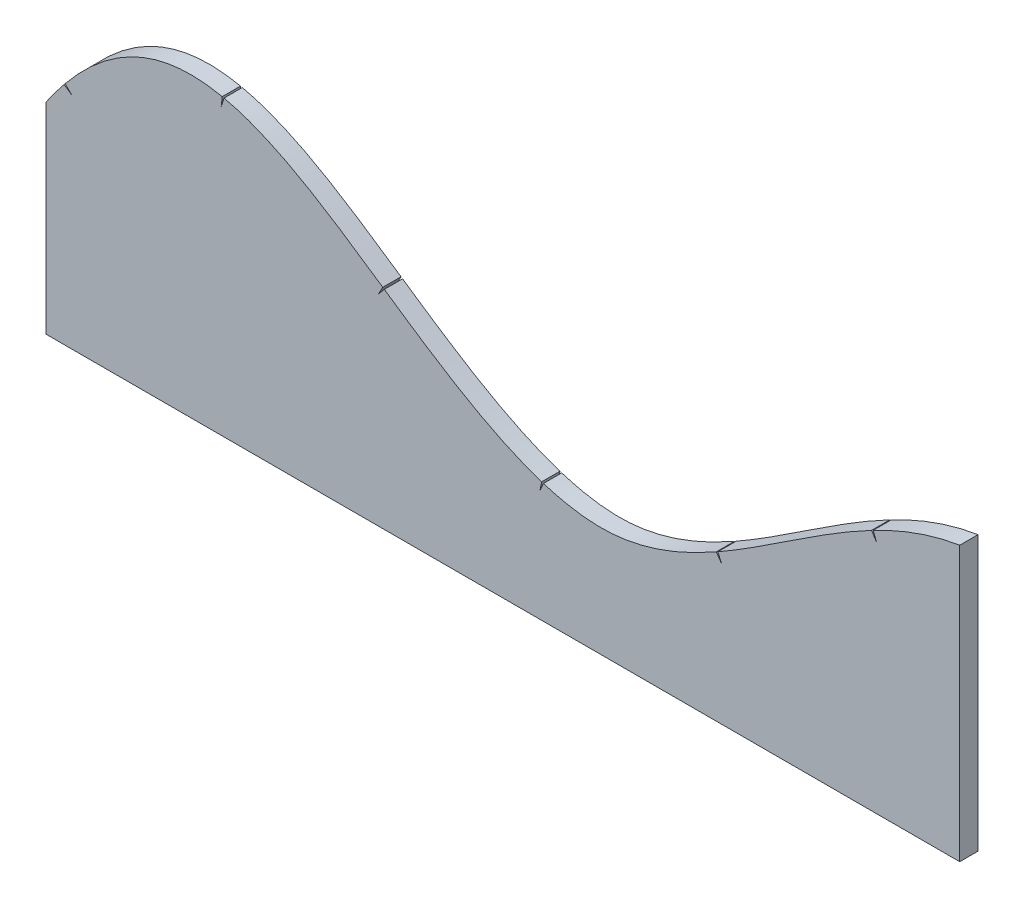
ISO-10303-21;
HEADER;
FILE_DESCRIPTION(('STEP AP214'),'2;1');
FILE_NAME('part.step','',(''),(''),'','','');
FILE_SCHEMA(('AUTOMOTIVE_DESIGN { 1 0 10303 214 1 1 1 1 }'));
ENDSEC;
DATA;
#1=APPLICATION_CONTEXT('core data for automotive mechanical design processes');
#2=APPLICATION_PROTOCOL_DEFINITION('international standard','automotive_design',2000,#1);
#3=PRODUCT_CONTEXT('',#1,'mechanical');
#4=PRODUCT('Part','Part','',(#3));
#5=PRODUCT_RELATED_PRODUCT_CATEGORY('part','',(#4));
#6=PRODUCT_DEFINITION_FORMATION('','',#4);
#7=PRODUCT_DEFINITION_CONTEXT('part definition',#1,'design');
#8=PRODUCT_DEFINITION('design','',#6,#7);
#9=PRODUCT_DEFINITION_SHAPE('','',#8);
#10=(LENGTH_UNIT() NAMED_UNIT(*) SI_UNIT(.MILLI.,.METRE.));
#11=(NAMED_UNIT(*) PLANE_ANGLE_UNIT() SI_UNIT($,.RADIAN.));
#12=(NAMED_UNIT(*) SI_UNIT($,.STERADIAN.) SOLID_ANGLE_UNIT());
#13=UNCERTAINTY_MEASURE_WITH_UNIT(LENGTH_MEASURE(1.E-05),#10,'distance_accuracy_value','');
#14=(GEOMETRIC_REPRESENTATION_CONTEXT(3) GLOBAL_UNCERTAINTY_ASSIGNED_CONTEXT((#13)) GLOBAL_UNIT_ASSIGNED_CONTEXT((#10,
#11,#12)) REPRESENTATION_CONTEXT('',''));
#15=CARTESIAN_POINT('',(0.,0.,0.));
#16=DIRECTION('',(0.,0.,1.));
#17=DIRECTION('',(1.,0.,0.));
#18=AXIS2_PLACEMENT_3D('',#15,#16,#17);
#19=CARTESIAN_POINT('',(2500.,1500.,100.));
#20=CARTESIAN_POINT('',(1794.60890413008,1389.62794411327,100.));
#21=CARTESIAN_POINT('',(898.832611168576,213.225882742989,100.));
#22=CARTESIAN_POINT('',(-869.308497066313,1207.64704133542,100.));
#23=CARTESIAN_POINT('',(-1828.84848091354,2075.83695286691,100.));
#24=CARTESIAN_POINT('',(-2500.,1100.,100.));
#25=B_SPLINE_CURVE_WITH_KNOTS('',3,(#19,#20,#21,#22,#23,#24),.UNSPECIFIED.,.F.,.F.,(4,1,1,4),
(0.,0.386573634956552,0.581979176283233,1.),.UNSPECIFIED.);
#26=DIRECTION('',(0.,0.,-1.));
#27=VECTOR('',#26,1.);
#28=SURFACE_OF_LINEAR_EXTRUSION('',#25,#27);
#29=CARTESIAN_POINT('',(2500.,1500.,0.));
#30=CARTESIAN_POINT('',(1794.60890413008,1389.62794411327,0.));
#31=CARTESIAN_POINT('',(898.832611168576,213.225882742989,0.));
#32=CARTESIAN_POINT('',(-869.308497066313,1207.64704133542,0.));
#33=CARTESIAN_POINT('',(-1828.84848091354,2075.83695286691,0.));
#34=CARTESIAN_POINT('',(-2500.,1100.,0.));
#35=B_SPLINE_CURVE_WITH_KNOTS('',3,(#29,#30,#31,#32,#33,#34),.UNSPECIFIED.,.F.,.F.,(4,1,1,4),
(0.,0.386573634956552,0.581979176283233,1.),.UNSPECIFIED.);
#36=CARTESIAN_POINT('',(-657.024415573471,1143.67553962413,0.));
#37=VERTEX_POINT('',#36);
#38=CARTESIAN_POINT('',(-1525.84913471507,1605.95378303103,0.));
#39=VERTEX_POINT('',#38);
#40=EDGE_CURVE('E442',#37,#39,#35,.T.);
#41=ORIENTED_EDGE('',*,*,#40,.T.);
#42=DIRECTION('',(0.,0.,-1.));
#43=VECTOR('',#42,1.);
#44=CARTESIAN_POINT('',(-1525.84913471507,1605.95378303104,100.));
#45=LINE('',#44,#43);
#46=CARTESIAN_POINT('',(-1525.84913471507,1605.95378303103,100.));
#47=VERTEX_POINT('',#46);
#48=EDGE_CURVE('E312',#39,#47,#45,.F.);
#49=ORIENTED_EDGE('',*,*,#48,.T.);
#50=CARTESIAN_POINT('',(-657.024415573471,1143.67553962413,100.));
#51=VERTEX_POINT('',#50);
#52=EDGE_CURVE('E500',#51,#47,#25,.T.);
#53=ORIENTED_EDGE('',*,*,#52,.F.);
#54=DIRECTION('',(0.,0.,-1.));
#55=VECTOR('',#54,1.);
#56=CARTESIAN_POINT('',(-657.024416114455,1143.6755399937,0.));
#57=LINE('',#56,#55);
#58=EDGE_CURVE('E308',#37,#51,#57,.F.);
#59=ORIENTED_EDGE('',*,*,#58,.F.);
#60=EDGE_LOOP('',(#41,#49,#53,#59));
#61=FACE_BOUND('',#60,.T.);
#62=ADVANCED_FACE('F35',(#61),#28,.F.);
#63=CARTESIAN_POINT('',(212.561468705833,656.843347329363,0.));
#64=VERTEX_POINT('',#63);
#65=CARTESIAN_POINT('',(-648.767193373434,1138.03476019735,0.));
#66=VERTEX_POINT('',#65);
#67=EDGE_CURVE('E445',#64,#66,#35,.T.);
#68=ORIENTED_EDGE('',*,*,#67,.T.);
#69=DIRECTION('',(0.,0.,-1.));
#70=VECTOR('',#69,1.);
#71=CARTESIAN_POINT('',(-648.767192386376,1138.03475952309,0.));
#72=LINE('',#71,#70);
#73=CARTESIAN_POINT('',(-648.767193373434,1138.03476019735,100.));
#74=VERTEX_POINT('',#73);
#75=EDGE_CURVE('E39',#66,#74,#72,.F.);
#76=ORIENTED_EDGE('',*,*,#75,.T.);
#77=CARTESIAN_POINT('',(212.561468705833,656.843347329363,100.));
#78=VERTEX_POINT('',#77);
#79=EDGE_CURVE('E354',#78,#74,#25,.T.);
#80=ORIENTED_EDGE('',*,*,#79,.F.);
#81=DIRECTION('',(0.,0.,-1.));
#82=VECTOR('',#81,1.);
#83=CARTESIAN_POINT('',(212.561468705833,656.843347329363,100.));
#84=LINE('',#83,#82);
#85=EDGE_CURVE('E302',#78,#64,#84,.T.);
#86=ORIENTED_EDGE('',*,*,#85,.T.);
#87=EDGE_LOOP('',(#68,#76,#80,#86));
#88=FACE_BOUND('',#87,.T.);
#89=ADVANCED_FACE('F432',(#88),#28,.F.);
#90=CARTESIAN_POINT('',(1167.74932960574,802.292417079743,0.));
#91=VERTEX_POINT('',#90);
#92=CARTESIAN_POINT('',(222.090144024189,653.803702021845,0.));
#93=VERTEX_POINT('',#92);
#94=EDGE_CURVE('E448',#91,#93,#35,.T.);
#95=ORIENTED_EDGE('',*,*,#94,.T.);
#96=DIRECTION('',(0.,0.,-1.));
#97=VECTOR('',#96,1.);
#98=CARTESIAN_POINT('',(222.090144024189,653.803702021845,100.));
#99=LINE('',#98,#97);
#100=CARTESIAN_POINT('',(222.090144024189,653.803702021845,100.));
#101=VERTEX_POINT('',#100);
#102=EDGE_CURVE('E305',#93,#101,#99,.F.);
#103=ORIENTED_EDGE('',*,*,#102,.T.);
#104=CARTESIAN_POINT('',(1167.74932960574,802.292417079743,100.));
#105=VERTEX_POINT('',#104);
#106=EDGE_CURVE('E501',#105,#101,#25,.T.);
#107=ORIENTED_EDGE('',*,*,#106,.F.);
#108=DIRECTION('',(0.,0.,-1.));
#109=VECTOR('',#108,1.);
#110=CARTESIAN_POINT('',(1167.74932960574,802.292417079743,100.));
#111=LINE('',#110,#109);
#112=EDGE_CURVE('E296',#105,#91,#111,.T.);
#113=ORIENTED_EDGE('',*,*,#112,.T.);
#114=EDGE_LOOP('',(#95,#103,#107,#113));
#115=FACE_BOUND('',#114,.T.);
#116=ADVANCED_FACE('F437',(#115),#28,.F.);
#117=CARTESIAN_POINT('',(2017.35673015273,1329.02244352963,0.));
#118=VERTEX_POINT('',#117);
#119=CARTESIAN_POINT('',(1176.45451786146,807.215461224853,0.));
#120=VERTEX_POINT('',#119);
#121=EDGE_CURVE('E457',#118,#120,#35,.T.);
#122=ORIENTED_EDGE('',*,*,#121,.T.);
#123=DIRECTION('',(0.,0.,-1.));
#124=VECTOR('',#123,1.);
#125=CARTESIAN_POINT('',(1176.45451786146,807.215461224853,100.));
#126=LINE('',#125,#124);
#127=CARTESIAN_POINT('',(1176.45451786146,807.215461224853,100.));
#128=VERTEX_POINT('',#127);
#129=EDGE_CURVE('E299',#120,#128,#126,.F.);
#130=ORIENTED_EDGE('',*,*,#129,.T.);
#131=CARTESIAN_POINT('',(2017.35673015273,1329.02244352963,100.));
#132=VERTEX_POINT('',#131);
#133=EDGE_CURVE('E353',#132,#128,#25,.T.);
#134=ORIENTED_EDGE('',*,*,#133,.F.);
#135=DIRECTION('',(0.,0.,-1.));
#136=VECTOR('',#135,1.);
#137=CARTESIAN_POINT('',(2017.35673015273,1329.02244352963,100.));
#138=LINE('',#137,#136);
#139=EDGE_CURVE('E289',#132,#118,#138,.T.);
#140=ORIENTED_EDGE('',*,*,#139,.T.);
#141=EDGE_LOOP('',(#122,#130,#134,#140));
#142=FACE_BOUND('',#141,.T.);
#143=ADVANCED_FACE('F606',(#142),#28,.F.);
#144=CARTESIAN_POINT('',(2500.,1500.,0.));
#145=VERTEX_POINT('',#144);
#146=CARTESIAN_POINT('',(2026.22728048429,1333.63695690014,0.));
#147=VERTEX_POINT('',#146);
#148=EDGE_CURVE('E449',#145,#147,#35,.T.);
#149=ORIENTED_EDGE('',*,*,#148,.T.);
#150=DIRECTION('',(0.,0.,-1.));
#151=VECTOR('',#150,1.);
#152=CARTESIAN_POINT('',(2026.22728048369,1333.63695690165,100.));
#153=LINE('',#152,#151);
#154=CARTESIAN_POINT('',(2026.22728048429,1333.63695690014,100.));
#155=VERTEX_POINT('',#154);
#156=EDGE_CURVE('E292',#147,#155,#153,.F.);
#157=ORIENTED_EDGE('',*,*,#156,.T.);
#158=CARTESIAN_POINT('',(2500.,1500.,100.));
#159=VERTEX_POINT('',#158);
#160=EDGE_CURVE('E346',#159,#155,#25,.T.);
#161=ORIENTED_EDGE('',*,*,#160,.F.);
#162=DIRECTION('',(0.,0.,-1.));
#163=VECTOR('',#162,1.);
#164=CARTESIAN_POINT('',(2500.,1500.,100.));
#165=LINE('',#164,#163);
#166=EDGE_CURVE('E473',#159,#145,#165,.T.);
#167=ORIENTED_EDGE('',*,*,#166,.T.);
#168=EDGE_LOOP('',(#149,#157,#161,#167));
#169=FACE_BOUND('',#168,.T.);
#170=ADVANCED_FACE('F614',(#169),#28,.F.);
#171=CARTESIAN_POINT('',(-1535.6218061162,1608.06171098821,100.));
#172=VERTEX_POINT('',#171);
#173=CARTESIAN_POINT('',(-2395.14412456295,1240.10126913903,100.));
#174=VERTEX_POINT('',#173);
#175=EDGE_CURVE('E498',#172,#174,#25,.T.);
#176=ORIENTED_EDGE('',*,*,#175,.F.);
#177=DIRECTION('',(0.,0.,-1.));
#178=VECTOR('',#177,1.);
#179=CARTESIAN_POINT('',(-1535.6218061162,1608.06171098821,100.));
#180=LINE('',#179,#178);
#181=CARTESIAN_POINT('',(-1535.6218061162,1608.06171098821,0.));
#182=VERTEX_POINT('',#181);
#183=EDGE_CURVE('E309',#172,#182,#180,.T.);
#184=ORIENTED_EDGE('',*,*,#183,.T.);
#185=CARTESIAN_POINT('',(-2395.14412456295,1240.10126913903,0.));
#186=VERTEX_POINT('',#185);
#187=EDGE_CURVE('E446',#182,#186,#35,.T.);
#188=ORIENTED_EDGE('',*,*,#187,.T.);
#189=DIRECTION('',(0.,0.,-1.));
#190=VECTOR('',#189,1.);
#191=CARTESIAN_POINT('',(-2395.14412456367,1240.10126913975,100.));
#192=LINE('',#191,#190);
#193=EDGE_CURVE('E337',#186,#174,#192,.F.);
#194=ORIENTED_EDGE('',*,*,#193,.T.);
#195=EDGE_LOOP('',(#176,#184,#188,#194));
#196=FACE_BOUND('',#195,.T.);
#197=ADVANCED_FACE('F364',(#196),#28,.F.);
#198=CARTESIAN_POINT('',(2500.,1500.,100.));
#199=DIRECTION('',(-1.,0.,0.));
#200=DIRECTION('',(0.,-1.,0.));
#201=AXIS2_PLACEMENT_3D('',#198,#199,#200);
#202=PLANE('',#201);
#203=DIRECTION('',(0.,1.,0.));
#204=VECTOR('',#203,1.);
#205=CARTESIAN_POINT('',(2500.,1500.,0.));
#206=LINE('',#205,#204);
#207=CARTESIAN_POINT('',(2500.,0.,0.));
#208=VERTEX_POINT('',#207);
#209=EDGE_CURVE('E340',#208,#145,#206,.T.);
#210=ORIENTED_EDGE('',*,*,#209,.T.);
#211=ORIENTED_EDGE('',*,*,#166,.F.);
#212=DIRECTION('',(0.,1.,0.));
#213=VECTOR('',#212,1.);
#214=CARTESIAN_POINT('',(2500.,1500.,100.));
#215=LINE('',#214,#213);
#216=CARTESIAN_POINT('',(2500.,0.,100.));
#217=VERTEX_POINT('',#216);
#218=EDGE_CURVE('E341',#217,#159,#215,.T.);
#219=ORIENTED_EDGE('',*,*,#218,.F.);
#220=DIRECTION('',(0.,0.,-1.));
#221=VECTOR('',#220,1.);
#222=CARTESIAN_POINT('',(2500.,0.,100.));
#223=LINE('',#222,#221);
#224=EDGE_CURVE('E463',#217,#208,#223,.T.);
#225=ORIENTED_EDGE('',*,*,#224,.T.);
#226=EDGE_LOOP('',(#210,#211,#219,#225));
#227=FACE_BOUND('',#226,.T.);
#228=ADVANCED_FACE('F37',(#227),#202,.F.);
#229=CARTESIAN_POINT('',(-2401.46072096389,1232.35058228518,100.));
#230=VERTEX_POINT('',#229);
#231=CARTESIAN_POINT('',(-2500.,1100.,100.));
#232=VERTEX_POINT('',#231);
#233=EDGE_CURVE('E344',#230,#232,#25,.T.);
#234=ORIENTED_EDGE('',*,*,#233,.F.);
#235=DIRECTION('',(0.,0.,-1.));
#236=VECTOR('',#235,1.);
#237=CARTESIAN_POINT('',(-2401.46072096388,1232.35058228518,100.));
#238=LINE('',#237,#236);
#239=CARTESIAN_POINT('',(-2401.46072096389,1232.35058228518,0.));
#240=VERTEX_POINT('',#239);
#241=EDGE_CURVE('E334',#230,#240,#238,.T.);
#242=ORIENTED_EDGE('',*,*,#241,.T.);
#243=CARTESIAN_POINT('',(-2500.,1100.,0.));
#244=VERTEX_POINT('',#243);
#245=EDGE_CURVE('E450',#240,#244,#35,.T.);
#246=ORIENTED_EDGE('',*,*,#245,.T.);
#247=DIRECTION('',(0.,0.,-1.));
#248=VECTOR('',#247,1.);
#249=CARTESIAN_POINT('',(-2500.,1100.,100.));
#250=LINE('',#249,#248);
#251=EDGE_CURVE('E470',#232,#244,#250,.T.);
#252=ORIENTED_EDGE('',*,*,#251,.F.);
#253=EDGE_LOOP('',(#234,#242,#246,#252));
#254=FACE_BOUND('',#253,.T.);
#255=ADVANCED_FACE('F359',(#254),#28,.F.);
#256=CARTESIAN_POINT('',(-2500.,1100.,100.));
#257=DIRECTION('',(1.,0.,0.));
#258=DIRECTION('',(0.,1.,0.));
#259=AXIS2_PLACEMENT_3D('',#256,#257,#258);
#260=PLANE('',#259);
#261=DIRECTION('',(0.,-1.,0.));
#262=VECTOR('',#261,1.);
#263=CARTESIAN_POINT('',(-2500.,1100.,0.));
#264=LINE('',#263,#262);
#265=CARTESIAN_POINT('',(-2500.,0.,0.));
#266=VERTEX_POINT('',#265);
#267=EDGE_CURVE('E456',#244,#266,#264,.T.);
#268=ORIENTED_EDGE('',*,*,#267,.T.);
#269=DIRECTION('',(0.,0.,-1.));
#270=VECTOR('',#269,1.);
#271=CARTESIAN_POINT('',(-2500.,0.,100.));
#272=LINE('',#271,#270);
#273=CARTESIAN_POINT('',(-2500.,0.,100.));
#274=VERTEX_POINT('',#273);
#275=EDGE_CURVE('E466',#274,#266,#272,.T.);
#276=ORIENTED_EDGE('',*,*,#275,.F.);
#277=DIRECTION('',(0.,-1.,0.));
#278=VECTOR('',#277,1.);
#279=CARTESIAN_POINT('',(-2500.,1100.,100.));
#280=LINE('',#279,#278);
#281=EDGE_CURVE('E352',#232,#274,#280,.T.);
#282=ORIENTED_EDGE('',*,*,#281,.F.);
#283=ORIENTED_EDGE('',*,*,#251,.T.);
#284=EDGE_LOOP('',(#268,#276,#282,#283));
#285=FACE_BOUND('',#284,.T.);
#286=ADVANCED_FACE('F362',(#285),#260,.F.);
#287=CARTESIAN_POINT('',(-2500.,0.,100.));
#288=DIRECTION('',(0.,1.,0.));
#289=DIRECTION('',(0.,0.,1.));
#290=AXIS2_PLACEMENT_3D('',#287,#288,#289);
#291=PLANE('',#290);
#292=DIRECTION('',(1.,0.,0.));
#293=VECTOR('',#292,1.);
#294=CARTESIAN_POINT('',(-2500.,0.,0.));
#295=LINE('',#294,#293);
#296=EDGE_CURVE('E345',#266,#208,#295,.T.);
#297=ORIENTED_EDGE('',*,*,#296,.T.);
#298=ORIENTED_EDGE('',*,*,#224,.F.);
#299=DIRECTION('',(1.,0.,0.));
#300=VECTOR('',#299,1.);
#301=CARTESIAN_POINT('',(-2500.,0.,100.));
#302=LINE('',#301,#300);
#303=EDGE_CURVE('E467',#274,#217,#302,.T.);
#304=ORIENTED_EDGE('',*,*,#303,.F.);
#305=ORIENTED_EDGE('',*,*,#275,.T.);
#306=EDGE_LOOP('',(#297,#298,#304,#305));
#307=FACE_BOUND('',#306,.T.);
#308=ADVANCED_FACE('F367',(#307),#291,.F.);
#309=CARTESIAN_POINT('',(-39.4677435568209,761.442893935409,100.));
#310=DIRECTION('',(0.,0.,1.));
#311=DIRECTION('',(1.,0.,0.));
#312=AXIS2_PLACEMENT_3D('',#309,#310,#311);
#313=PLANE('',#312);
#314=DIRECTION('',(0.307075093505158,0.951685287765236,0.));
#315=VECTOR('',#314,1.);
#316=CARTESIAN_POINT('',(-1525.84517059411,1605.96606861094,100.));
#317=LINE('',#316,#315);
#318=CARTESIAN_POINT('',(-1541.27550307447,1558.14447474849,100.));
#319=VERTEX_POINT('',#318);
#320=EDGE_CURVE('E488',#319,#47,#317,.T.);
#321=ORIENTED_EDGE('',*,*,#320,.F.);
#322=DIRECTION('',(-0.11254186635352,-0.993646983751104,0.));
#323=VECTOR('',#322,1.);
#324=CARTESIAN_POINT('',(-1535.62034427936,1608.07461773849,100.));
#325=LINE('',#324,#323);
#326=EDGE_CURVE('E487',#172,#319,#325,.T.);
#327=ORIENTED_EDGE('',*,*,#326,.F.);
#328=ORIENTED_EDGE('',*,*,#175,.T.);
#329=DIRECTION('',(-0.708469748946863,0.705741181189796,0.));
#330=VECTOR('',#329,1.);
#331=CARTESIAN_POINT('',(-2395.14902736659,1240.10615306024,100.));
#332=LINE('',#331,#330);
#333=CARTESIAN_POINT('',(-2359.54886307538,1204.64309760194,100.));
#334=VERTEX_POINT('',#333);
#335=EDGE_CURVE('E328',#334,#174,#332,.T.);
#336=ORIENTED_EDGE('',*,*,#335,.F.);
#337=DIRECTION('',(0.834191373955798,-0.551475068899527,0.));
#338=VECTOR('',#337,1.);
#339=CARTESIAN_POINT('',(-2401.46646083772,1232.35437685489,100.));
#340=LINE('',#339,#338);
#341=EDGE_CURVE('E315',#230,#334,#340,.T.);
#342=ORIENTED_EDGE('',*,*,#341,.F.);
#343=ORIENTED_EDGE('',*,*,#233,.T.);
#344=ORIENTED_EDGE('',*,*,#281,.T.);
#345=ORIENTED_EDGE('',*,*,#303,.T.);
#346=ORIENTED_EDGE('',*,*,#218,.T.);
#347=ORIENTED_EDGE('',*,*,#160,.T.);
#348=DIRECTION('',(-0.370935621162363,0.928658583631731,0.));
#349=VECTOR('',#348,1.);
#350=CARTESIAN_POINT('',(2026.2254468365,1333.64154754245,100.));
#351=LINE('',#350,#349);
#352=CARTESIAN_POINT('',(2044.86473111713,1286.97703124253,100.));
#353=VERTEX_POINT('',#352);
#354=EDGE_CURVE('E283',#353,#155,#351,.T.);
#355=ORIENTED_EDGE('',*,*,#354,.F.);
#356=DIRECTION('',(0.547483150175335,-0.836816706497959,0.));
#357=VECTOR('',#356,1.);
#358=CARTESIAN_POINT('',(2017.35404329752,1329.02655033243,100.));
#359=LINE('',#358,#357);
#360=EDGE_CURVE('E284',#132,#353,#359,.T.);
#361=ORIENTED_EDGE('',*,*,#360,.F.);
#362=ORIENTED_EDGE('',*,*,#133,.T.);
#363=CARTESIAN_POINT('',(1171.85785169645,805.185520297766,100.));
#364=DIRECTION('',(0.,0.,1.));
#365=DIRECTION('',(-0.931491675153893,0.363762641181024,0.));
#366=AXIS2_PLACEMENT_3D('',#363,#364,#365);
#367=CIRCLE('',#366,5.02493781056051);
#368=CARTESIAN_POINT('',(1176.45620676885,807.211632493118,100.));
#369=VERTEX_POINT('',#368);
#370=EDGE_CURVE('E265',#369,#128,#367,.T.);
#371=ORIENTED_EDGE('',*,*,#370,.F.);
#372=DIRECTION('',(-0.403211397182555,0.915106862165338,0.));
#373=VECTOR('',#372,1.);
#374=CARTESIAN_POINT('',(1176.45620676885,807.211632493118,100.));
#375=LINE('',#374,#373);
#376=CARTESIAN_POINT('',(1196.71732872236,761.228081769138,100.));
#377=VERTEX_POINT('',#376);
#378=EDGE_CURVE('E258',#377,#369,#375,.T.);
#379=ORIENTED_EDGE('',*,*,#378,.F.);
#380=DIRECTION('',(0.576436292716634,-0.817142093175418,0.));
#381=VECTOR('',#380,1.);
#382=CARTESIAN_POINT('',(1167.75176349585,802.288963775115,100.));
#383=LINE('',#382,#381);
#384=CARTESIAN_POINT('',(1167.75176349585,802.288963775115,100.));
#385=VERTEX_POINT('',#384);
#386=EDGE_CURVE('E267',#385,#377,#383,.T.);
#387=ORIENTED_EDGE('',*,*,#386,.F.);
#388=EDGE_CURVE('E268',#105,#385,#367,.T.);
#389=ORIENTED_EDGE('',*,*,#388,.F.);
#390=ORIENTED_EDGE('',*,*,#106,.T.);
#391=CARTESIAN_POINT('',(217.475071563137,655.791440983388,100.));
#392=DIRECTION('',(0.,0.,1.));
#393=DIRECTION('',(-0.366271805079571,0.930507906900179,0.));
#394=AXIS2_PLACEMENT_3D('',#391,#392,#393);
#395=CIRCLE('',#394,5.02493781056051);
#396=CARTESIAN_POINT('',(222.086606732764,653.795509276317,100.));
#397=VERTEX_POINT('',#396);
#398=EDGE_CURVE('E246',#397,#101,#395,.T.);
#399=ORIENTED_EDGE('',*,*,#398,.F.);
#400=DIRECTION('',(0.39720525553114,0.917729799548016,0.));
#401=VECTOR('',#400,1.);
#402=CARTESIAN_POINT('',(222.086606732764,653.795509276317,100.));
#403=LINE('',#402,#401);
#404=CARTESIAN_POINT('',(202.127289662046,607.680157580048,100.));
#405=VERTEX_POINT('',#404);
#406=EDGE_CURVE('E242',#405,#397,#403,.T.);
#407=ORIENTED_EDGE('',*,*,#406,.F.);
#408=DIRECTION('',(-0.207611131748734,-0.978211438276005,0.));
#409=VECTOR('',#408,1.);
#410=CARTESIAN_POINT('',(212.559619920221,656.834674009206,100.));
#411=LINE('',#410,#409);
#412=CARTESIAN_POINT('',(212.559619920221,656.834674009206,100.));
#413=VERTEX_POINT('',#412);
#414=EDGE_CURVE('E235',#413,#405,#411,.T.);
#415=ORIENTED_EDGE('',*,*,#414,.F.);
#416=EDGE_CURVE('E248',#78,#413,#395,.T.);
#417=ORIENTED_EDGE('',*,*,#416,.F.);
#418=ORIENTED_EDGE('',*,*,#79,.T.);
#419=DIRECTION('',(0.643442259145116,0.765494649978842,0.));
#420=VECTOR('',#419,1.);
#421=CARTESIAN_POINT('',(-648.767223297881,1138.03472274808,100.));
#422=LINE('',#421,#420);
#423=CARTESIAN_POINT('',(-681.099796666788,1099.56909264348,100.));
#424=VERTEX_POINT('',#423);
#425=EDGE_CURVE('E81',#424,#74,#422,.T.);
#426=ORIENTED_EDGE('',*,*,#425,.F.);
#427=DIRECTION('',(-0.479117729265241,-0.87775064881988,0.));
#428=VECTOR('',#427,1.);
#429=CARTESIAN_POINT('',(-657.02442873184,1143.67551687847,100.));
#430=LINE('',#429,#428);
#431=EDGE_CURVE('E251',#51,#424,#430,.T.);
#432=ORIENTED_EDGE('',*,*,#431,.F.);
#433=ORIENTED_EDGE('',*,*,#52,.T.);
#434=EDGE_LOOP('',(#321,#327,#328,#336,#342,#343,#344,#345,#346,#347,#355,#361,#362,#371,#379,
#387,#389,#390,#399,#407,#415,#417,#418,#426,#432,#433));
#435=FACE_BOUND('',#434,.T.);
#436=ADVANCED_FACE('F371',(#435),#313,.T.);
#437=CARTESIAN_POINT('',(-39.4677435568209,761.442893935409,0.));
#438=DIRECTION('',(0.,0.,1.));
#439=DIRECTION('',(1.,0.,0.));
#440=AXIS2_PLACEMENT_3D('',#437,#438,#439);
#441=PLANE('',#440);
#442=DIRECTION('',(-0.11254186635352,-0.993646983751104,0.));
#443=VECTOR('',#442,1.);
#444=CARTESIAN_POINT('',(-1611.3467559542,939.476139776208,0.));
#445=LINE('',#444,#443);
#446=CARTESIAN_POINT('',(-1541.27550307447,1558.14447474849,0.));
#447=VERTEX_POINT('',#446);
#448=EDGE_CURVE('E11',#182,#447,#445,.T.);
#449=ORIENTED_EDGE('',*,*,#448,.T.);
#450=DIRECTION('',(0.307075093505158,0.951685287765236,0.));
#451=VECTOR('',#450,1.);
#452=CARTESIAN_POINT('',(-1525.84517059411,1605.96606861094,0.));
#453=LINE('',#452,#451);
#454=EDGE_CURVE('E54',#447,#39,#453,.T.);
#455=ORIENTED_EDGE('',*,*,#454,.T.);
#456=ORIENTED_EDGE('',*,*,#40,.F.);
#457=DIRECTION('',(-0.479117729265241,-0.87775064881988,0.));
#458=VECTOR('',#457,1.);
#459=CARTESIAN_POINT('',(-657.02442873184,1143.67551687847,0.));
#460=LINE('',#459,#458);
#461=CARTESIAN_POINT('',(-681.099796666788,1099.56909264348,0.));
#462=VERTEX_POINT('',#461);
#463=EDGE_CURVE('E316',#37,#462,#460,.T.);
#464=ORIENTED_EDGE('',*,*,#463,.T.);
#465=DIRECTION('',(0.643442259145116,0.765494649978842,0.));
#466=VECTOR('',#465,1.);
#467=CARTESIAN_POINT('',(-648.767223297881,1138.03472274808,0.));
#468=LINE('',#467,#466);
#469=EDGE_CURVE('E319',#462,#66,#468,.T.);
#470=ORIENTED_EDGE('',*,*,#469,.T.);
#471=ORIENTED_EDGE('',*,*,#67,.F.);
#472=CARTESIAN_POINT('',(217.475071563137,655.791440983388,0.));
#473=DIRECTION('',(0.,0.,1.));
#474=DIRECTION('',(1.,0.,0.));
#475=AXIS2_PLACEMENT_3D('',#472,#473,#474);
#476=CIRCLE('',#475,5.02493781056051);
#477=CARTESIAN_POINT('',(212.559619920221,656.834674009206,0.));
#478=VERTEX_POINT('',#477);
#479=EDGE_CURVE('E45',#64,#478,#476,.T.);
#480=ORIENTED_EDGE('',*,*,#479,.T.);
#481=DIRECTION('',(-0.207611131748734,-0.978211438276005,0.));
#482=VECTOR('',#481,1.);
#483=CARTESIAN_POINT('',(212.559619920221,656.834674009206,0.));
#484=LINE('',#483,#482);
#485=CARTESIAN_POINT('',(202.127289662046,607.680157580048,0.));
#486=VERTEX_POINT('',#485);
#487=EDGE_CURVE('E227',#478,#486,#484,.T.);
#488=ORIENTED_EDGE('',*,*,#487,.T.);
#489=DIRECTION('',(0.39720525553114,0.917729799548016,0.));
#490=VECTOR('',#489,1.);
#491=CARTESIAN_POINT('',(222.086606732764,653.795509276317,0.));
#492=LINE('',#491,#490);
#493=CARTESIAN_POINT('',(222.086606732764,653.795509276317,0.));
#494=VERTEX_POINT('',#493);
#495=EDGE_CURVE('E215',#486,#494,#492,.T.);
#496=ORIENTED_EDGE('',*,*,#495,.T.);
#497=CARTESIAN_POINT('',(217.475071563137,655.791440983388,0.));
#498=DIRECTION('',(0.,0.,1.));
#499=DIRECTION('',(-0.366271805079571,0.930507906900179,0.));
#500=AXIS2_PLACEMENT_3D('',#497,#498,#499);
#501=CIRCLE('',#500,5.02493781056051);
#502=EDGE_CURVE('E240',#494,#93,#501,.T.);
#503=ORIENTED_EDGE('',*,*,#502,.T.);
#504=ORIENTED_EDGE('',*,*,#94,.F.);
#505=CARTESIAN_POINT('',(1171.85785169645,805.185520297766,0.));
#506=DIRECTION('',(0.,0.,1.));
#507=DIRECTION('',(1.,0.,0.));
#508=AXIS2_PLACEMENT_3D('',#505,#506,#507);
#509=CIRCLE('',#508,5.02493781056051);
#510=CARTESIAN_POINT('',(1167.75176349585,802.288963775115,0.));
#511=VERTEX_POINT('',#510);
#512=EDGE_CURVE('E482',#91,#511,#509,.T.);
#513=ORIENTED_EDGE('',*,*,#512,.T.);
#514=DIRECTION('',(0.576436292716634,-0.817142093175418,0.));
#515=VECTOR('',#514,1.);
#516=CARTESIAN_POINT('',(1167.75176349585,802.288963775115,0.));
#517=LINE('',#516,#515);
#518=CARTESIAN_POINT('',(1196.71732872236,761.228081769138,0.));
#519=VERTEX_POINT('',#518);
#520=EDGE_CURVE('E257',#511,#519,#517,.T.);
#521=ORIENTED_EDGE('',*,*,#520,.T.);
#522=DIRECTION('',(-0.403211397182555,0.915106862165338,0.));
#523=VECTOR('',#522,1.);
#524=CARTESIAN_POINT('',(1176.45620676885,807.211632493118,0.));
#525=LINE('',#524,#523);
#526=CARTESIAN_POINT('',(1176.45620676885,807.211632493118,0.));
#527=VERTEX_POINT('',#526);
#528=EDGE_CURVE('E261',#519,#527,#525,.T.);
#529=ORIENTED_EDGE('',*,*,#528,.T.);
#530=CARTESIAN_POINT('',(1171.85785169645,805.185520297766,0.));
#531=DIRECTION('',(0.,0.,1.));
#532=DIRECTION('',(-0.931491675153893,0.363762641181024,0.));
#533=AXIS2_PLACEMENT_3D('',#530,#531,#532);
#534=CIRCLE('',#533,5.02493781056051);
#535=EDGE_CURVE('E254',#527,#120,#534,.T.);
#536=ORIENTED_EDGE('',*,*,#535,.T.);
#537=ORIENTED_EDGE('',*,*,#121,.F.);
#538=DIRECTION('',(0.547483150175335,-0.836816706497959,0.));
#539=VECTOR('',#538,1.);
#540=CARTESIAN_POINT('',(1660.88131201553,1873.88776999224,0.));
#541=LINE('',#540,#539);
#542=CARTESIAN_POINT('',(2044.86473111713,1286.97703124253,0.));
#543=VERTEX_POINT('',#542);
#544=EDGE_CURVE('E479',#118,#543,#541,.T.);
#545=ORIENTED_EDGE('',*,*,#544,.T.);
#546=DIRECTION('',(-0.370935621162363,0.928658583631731,0.));
#547=VECTOR('',#546,1.);
#548=CARTESIAN_POINT('',(2026.2254468365,1333.64154754245,0.));
#549=LINE('',#548,#547);
#550=EDGE_CURVE('E279',#543,#147,#549,.T.);
#551=ORIENTED_EDGE('',*,*,#550,.T.);
#552=ORIENTED_EDGE('',*,*,#148,.F.);
#553=ORIENTED_EDGE('',*,*,#209,.F.);
#554=ORIENTED_EDGE('',*,*,#296,.F.);
#555=ORIENTED_EDGE('',*,*,#267,.F.);
#556=ORIENTED_EDGE('',*,*,#245,.F.);
#557=DIRECTION('',(0.834191373955798,-0.551475068899527,0.));
#558=VECTOR('',#557,1.);
#559=CARTESIAN_POINT('',(-541.173901695983,2.53469847455179,0.));
#560=LINE('',#559,#558);
#561=CARTESIAN_POINT('',(-2359.54886307538,1204.64309760194,0.));
#562=VERTEX_POINT('',#561);
#563=EDGE_CURVE('E476',#240,#562,#560,.T.);
#564=ORIENTED_EDGE('',*,*,#563,.T.);
#565=DIRECTION('',(-0.708469748946863,0.705741181189796,0.));
#566=VECTOR('',#565,1.);
#567=CARTESIAN_POINT('',(-2395.14902736659,1240.10615306024,0.));
#568=LINE('',#567,#566);
#569=EDGE_CURVE('E324',#562,#186,#568,.T.);
#570=ORIENTED_EDGE('',*,*,#569,.T.);
#571=ORIENTED_EDGE('',*,*,#187,.F.);
#572=EDGE_LOOP('',(#449,#455,#456,#464,#470,#471,#480,#488,#496,#503,#504,#513,#521,#529,#536,
#537,#545,#551,#552,#553,#554,#555,#556,#564,#570,#571));
#573=FACE_BOUND('',#572,.T.);
#574=ADVANCED_FACE('F238',(#573),#441,.F.);
#575=CARTESIAN_POINT('',(-2395.14902736659,1240.10615306024,0.));
#576=DIRECTION('',(0.705741181189796,0.708469748946863,0.));
#577=DIRECTION('',(-0.708469748946863,0.705741181189796,0.));
#578=AXIS2_PLACEMENT_3D('',#575,#576,#577);
#579=PLANE('',#578);
#580=ORIENTED_EDGE('',*,*,#569,.F.);
#581=DIRECTION('',(0.,0.,1.));
#582=VECTOR('',#581,1.);
#583=CARTESIAN_POINT('',(-2359.54886307538,1204.64309760194,0.));
#584=LINE('',#583,#582);
#585=EDGE_CURVE('E327',#562,#334,#584,.T.);
#586=ORIENTED_EDGE('',*,*,#585,.T.);
#587=ORIENTED_EDGE('',*,*,#335,.T.);
#588=ORIENTED_EDGE('',*,*,#193,.F.);
#589=EDGE_LOOP('',(#580,#586,#587,#588));
#590=FACE_BOUND('',#589,.T.);
#591=ADVANCED_FACE('F375',(#590),#579,.F.);
#592=CARTESIAN_POINT('',(-2401.46646083772,1232.35437685489,0.));
#593=DIRECTION('',(-0.551475068899527,-0.834191373955798,0.));
#594=DIRECTION('',(0.834191373955798,-0.551475068899527,0.));
#595=AXIS2_PLACEMENT_3D('',#592,#593,#594);
#596=PLANE('',#595);
#597=ORIENTED_EDGE('',*,*,#341,.T.);
#598=ORIENTED_EDGE('',*,*,#585,.F.);
#599=ORIENTED_EDGE('',*,*,#563,.F.);
#600=ORIENTED_EDGE('',*,*,#241,.F.);
#601=EDGE_LOOP('',(#597,#598,#599,#600));
#602=FACE_BOUND('',#601,.T.);
#603=ADVANCED_FACE('F379',(#602),#596,.F.);
#604=CARTESIAN_POINT('',(2026.2254468365,1333.64154754245,0.));
#605=DIRECTION('',(0.928658583631731,0.370935621162363,0.));
#606=DIRECTION('',(-0.370935621162363,0.928658583631731,0.));
#607=AXIS2_PLACEMENT_3D('',#604,#605,#606);
#608=PLANE('',#607);
#609=ORIENTED_EDGE('',*,*,#550,.F.);
#610=DIRECTION('',(0.,0.,1.));
#611=VECTOR('',#610,1.);
#612=CARTESIAN_POINT('',(2044.86473111713,1286.97703124253,0.));
#613=LINE('',#612,#611);
#614=EDGE_CURVE('E282',#543,#353,#613,.T.);
#615=ORIENTED_EDGE('',*,*,#614,.T.);
#616=ORIENTED_EDGE('',*,*,#354,.T.);
#617=ORIENTED_EDGE('',*,*,#156,.F.);
#618=EDGE_LOOP('',(#609,#615,#616,#617));
#619=FACE_BOUND('',#618,.T.);
#620=ADVANCED_FACE('F382',(#619),#608,.F.);
#621=CARTESIAN_POINT('',(2017.35404329752,1329.02655033243,0.));
#622=DIRECTION('',(-0.836816706497959,-0.547483150175335,0.));
#623=DIRECTION('',(0.547483150175335,-0.836816706497959,0.));
#624=AXIS2_PLACEMENT_3D('',#621,#622,#623);
#625=PLANE('',#624);
#626=ORIENTED_EDGE('',*,*,#360,.T.);
#627=ORIENTED_EDGE('',*,*,#614,.F.);
#628=ORIENTED_EDGE('',*,*,#544,.F.);
#629=ORIENTED_EDGE('',*,*,#139,.F.);
#630=EDGE_LOOP('',(#626,#627,#628,#629));
#631=FACE_BOUND('',#630,.T.);
#632=ADVANCED_FACE('F387',(#631),#625,.F.);
#633=CARTESIAN_POINT('',(1171.85785169645,805.185520297766,0.));
#634=DIRECTION('',(0.,0.,1.));
#635=DIRECTION('',(1.,0.,0.));
#636=AXIS2_PLACEMENT_3D('',#633,#634,#635);
#637=CYLINDRICAL_SURFACE('',#636,5.02493781056051);
#638=ORIENTED_EDGE('',*,*,#535,.F.);
#639=DIRECTION('',(0.,0.,1.));
#640=VECTOR('',#639,1.);
#641=CARTESIAN_POINT('',(1176.45620676885,807.211632493118,0.));
#642=LINE('',#641,#640);
#643=EDGE_CURVE('E273',#527,#369,#642,.T.);
#644=ORIENTED_EDGE('',*,*,#643,.T.);
#645=ORIENTED_EDGE('',*,*,#370,.T.);
#646=ORIENTED_EDGE('',*,*,#129,.F.);
#647=EDGE_LOOP('',(#638,#644,#645,#646));
#648=FACE_BOUND('',#647,.T.);
#649=ADVANCED_FACE('F390',(#648),#637,.F.);
#650=ORIENTED_EDGE('',*,*,#388,.T.);
#651=DIRECTION('',(0.,0.,1.));
#652=VECTOR('',#651,1.);
#653=CARTESIAN_POINT('',(1167.75176349585,802.288963775115,0.));
#654=LINE('',#653,#652);
#655=EDGE_CURVE('E264',#511,#385,#654,.T.);
#656=ORIENTED_EDGE('',*,*,#655,.F.);
#657=ORIENTED_EDGE('',*,*,#512,.F.);
#658=ORIENTED_EDGE('',*,*,#112,.F.);
#659=EDGE_LOOP('',(#650,#656,#657,#658));
#660=FACE_BOUND('',#659,.T.);
#661=ADVANCED_FACE('F397',(#660),#637,.F.);
#662=CARTESIAN_POINT('',(1176.45620676885,807.211632493118,0.));
#663=DIRECTION('',(0.915106862165338,0.403211397182555,0.));
#664=DIRECTION('',(-0.403211397182555,0.915106862165338,0.));
#665=AXIS2_PLACEMENT_3D('',#662,#663,#664);
#666=PLANE('',#665);
#667=ORIENTED_EDGE('',*,*,#378,.T.);
#668=ORIENTED_EDGE('',*,*,#643,.F.);
#669=ORIENTED_EDGE('',*,*,#528,.F.);
#670=DIRECTION('',(0.,0.,1.));
#671=VECTOR('',#670,1.);
#672=CARTESIAN_POINT('',(1196.71732872236,761.228081769138,0.));
#673=LINE('',#672,#671);
#674=EDGE_CURVE('E275',#519,#377,#673,.T.);
#675=ORIENTED_EDGE('',*,*,#674,.T.);
#676=EDGE_LOOP('',(#667,#668,#669,#675));
#677=FACE_BOUND('',#676,.T.);
#678=ADVANCED_FACE('F403',(#677),#666,.F.);
#679=CARTESIAN_POINT('',(1167.75176349585,802.288963775115,0.));
#680=DIRECTION('',(-0.817142093175418,-0.576436292716634,0.));
#681=DIRECTION('',(0.576436292716634,-0.817142093175418,0.));
#682=AXIS2_PLACEMENT_3D('',#679,#680,#681);
#683=PLANE('',#682);
#684=ORIENTED_EDGE('',*,*,#386,.T.);
#685=ORIENTED_EDGE('',*,*,#674,.F.);
#686=ORIENTED_EDGE('',*,*,#520,.F.);
#687=ORIENTED_EDGE('',*,*,#655,.T.);
#688=EDGE_LOOP('',(#684,#685,#686,#687));
#689=FACE_BOUND('',#688,.T.);
#690=ADVANCED_FACE('F399',(#689),#683,.F.);
#691=CARTESIAN_POINT('',(217.475071563137,655.791440983388,0.));
#692=DIRECTION('',(0.,0.,1.));
#693=DIRECTION('',(1.,0.,0.));
#694=AXIS2_PLACEMENT_3D('',#691,#692,#693);
#695=CYLINDRICAL_SURFACE('',#694,5.02493781056051);
#696=ORIENTED_EDGE('',*,*,#502,.F.);
#697=DIRECTION('',(0.,0.,1.));
#698=VECTOR('',#697,1.);
#699=CARTESIAN_POINT('',(222.086606732764,653.795509276317,0.));
#700=LINE('',#699,#698);
#701=EDGE_CURVE('E221',#494,#397,#700,.T.);
#702=ORIENTED_EDGE('',*,*,#701,.T.);
#703=ORIENTED_EDGE('',*,*,#398,.T.);
#704=ORIENTED_EDGE('',*,*,#102,.F.);
#705=EDGE_LOOP('',(#696,#702,#703,#704));
#706=FACE_BOUND('',#705,.T.);
#707=ADVANCED_FACE('F402',(#706),#695,.F.);
#708=ORIENTED_EDGE('',*,*,#416,.T.);
#709=DIRECTION('',(0.,0.,1.));
#710=VECTOR('',#709,1.);
#711=CARTESIAN_POINT('',(212.559619920221,656.834674009206,0.));
#712=LINE('',#711,#710);
#713=EDGE_CURVE('E226',#478,#413,#712,.T.);
#714=ORIENTED_EDGE('',*,*,#713,.F.);
#715=ORIENTED_EDGE('',*,*,#479,.F.);
#716=ORIENTED_EDGE('',*,*,#85,.F.);
#717=EDGE_LOOP('',(#708,#714,#715,#716));
#718=FACE_BOUND('',#717,.T.);
#719=ADVANCED_FACE('F410',(#718),#695,.F.);
#720=CARTESIAN_POINT('',(222.086606732764,653.795509276317,0.));
#721=DIRECTION('',(0.917729799548016,-0.39720525553114,0.));
#722=DIRECTION('',(0.39720525553114,0.917729799548016,0.));
#723=AXIS2_PLACEMENT_3D('',#720,#721,#722);
#724=PLANE('',#723);
#725=ORIENTED_EDGE('',*,*,#406,.T.);
#726=ORIENTED_EDGE('',*,*,#701,.F.);
#727=ORIENTED_EDGE('',*,*,#495,.F.);
#728=DIRECTION('',(0.,0.,1.));
#729=VECTOR('',#728,1.);
#730=CARTESIAN_POINT('',(202.127289662046,607.680157580048,0.));
#731=LINE('',#730,#729);
#732=EDGE_CURVE('E219',#486,#405,#731,.T.);
#733=ORIENTED_EDGE('',*,*,#732,.T.);
#734=EDGE_LOOP('',(#725,#726,#727,#733));
#735=FACE_BOUND('',#734,.T.);
#736=ADVANCED_FACE('F218',(#735),#724,.F.);
#737=CARTESIAN_POINT('',(212.559619920221,656.834674009206,0.));
#738=DIRECTION('',(-0.978211438276005,0.207611131748734,0.));
#739=DIRECTION('',(-0.207611131748734,-0.978211438276005,0.));
#740=AXIS2_PLACEMENT_3D('',#737,#738,#739);
#741=PLANE('',#740);
#742=ORIENTED_EDGE('',*,*,#414,.T.);
#743=ORIENTED_EDGE('',*,*,#732,.F.);
#744=ORIENTED_EDGE('',*,*,#487,.F.);
#745=ORIENTED_EDGE('',*,*,#713,.T.);
#746=EDGE_LOOP('',(#742,#743,#744,#745));
#747=FACE_BOUND('',#746,.T.);
#748=ADVANCED_FACE('F231',(#747),#741,.F.);
#749=CARTESIAN_POINT('',(-648.767223297881,1138.03472274808,0.));
#750=DIRECTION('',(0.765494649978842,-0.643442259145115,0.));
#751=DIRECTION('',(0.643442259145115,0.765494649978842,0.));
#752=AXIS2_PLACEMENT_3D('',#749,#750,#751);
#753=PLANE('',#752);
#754=ORIENTED_EDGE('',*,*,#425,.T.);
#755=ORIENTED_EDGE('',*,*,#75,.F.);
#756=ORIENTED_EDGE('',*,*,#469,.F.);
#757=DIRECTION('',(0.,0.,1.));
#758=VECTOR('',#757,1.);
#759=CARTESIAN_POINT('',(-681.099796666788,1099.56909264348,0.));
#760=LINE('',#759,#758);
#761=EDGE_CURVE('E86',#462,#424,#760,.T.);
#762=ORIENTED_EDGE('',*,*,#761,.T.);
#763=EDGE_LOOP('',(#754,#755,#756,#762));
#764=FACE_BOUND('',#763,.T.);
#765=ADVANCED_FACE('F414',(#764),#753,.F.);
#766=CARTESIAN_POINT('',(-657.02442873184,1143.67551687847,0.));
#767=DIRECTION('',(-0.87775064881988,0.479117729265241,0.));
#768=DIRECTION('',(-0.479117729265241,-0.87775064881988,0.));
#769=AXIS2_PLACEMENT_3D('',#766,#767,#768);
#770=PLANE('',#769);
#771=ORIENTED_EDGE('',*,*,#431,.T.);
#772=ORIENTED_EDGE('',*,*,#761,.F.);
#773=ORIENTED_EDGE('',*,*,#463,.F.);
#774=ORIENTED_EDGE('',*,*,#58,.T.);
#775=EDGE_LOOP('',(#771,#772,#773,#774));
#776=FACE_BOUND('',#775,.T.);
#777=ADVANCED_FACE('F417',(#776),#770,.F.);
#778=CARTESIAN_POINT('',(-1525.84517059411,1605.96606861094,0.));
#779=DIRECTION('',(0.951685287765235,-0.307075093505157,0.));
#780=DIRECTION('',(0.307075093505157,0.951685287765236,0.));
#781=AXIS2_PLACEMENT_3D('',#778,#779,#780);
#782=PLANE('',#781);
#783=ORIENTED_EDGE('',*,*,#454,.F.);
#784=DIRECTION('',(0.,0.,1.));
#785=VECTOR('',#784,1.);
#786=CARTESIAN_POINT('',(-1541.27550307447,1558.14447474849,0.));
#787=LINE('',#786,#785);
#788=EDGE_CURVE('E293',#447,#319,#787,.T.);
#789=ORIENTED_EDGE('',*,*,#788,.T.);
#790=ORIENTED_EDGE('',*,*,#320,.T.);
#791=ORIENTED_EDGE('',*,*,#48,.F.);
#792=EDGE_LOOP('',(#783,#789,#790,#791));
#793=FACE_BOUND('',#792,.T.);
#794=ADVANCED_FACE('F420',(#793),#782,.F.);
#795=CARTESIAN_POINT('',(-1535.62034427936,1608.07461773849,0.));
#796=DIRECTION('',(-0.993646983751104,0.11254186635352,0.));
#797=DIRECTION('',(-0.11254186635352,-0.993646983751104,0.));
#798=AXIS2_PLACEMENT_3D('',#795,#796,#797);
#799=PLANE('',#798);
#800=ORIENTED_EDGE('',*,*,#326,.T.);
#801=ORIENTED_EDGE('',*,*,#788,.F.);
#802=ORIENTED_EDGE('',*,*,#448,.F.);
#803=ORIENTED_EDGE('',*,*,#183,.F.);
#804=EDGE_LOOP('',(#800,#801,#802,#803));
#805=FACE_BOUND('',#804,.T.);
#806=ADVANCED_FACE('F424',(#805),#799,.F.);
#807=CLOSED_SHELL('',(#62,#89,#116,#143,#170,#197,#228,#255,#286,#308,#436,#574,#591,#603,#620,
#632,#649,#661,#678,#690,#707,#719,#736,#748,#765,#777,#794,#806));
#808=MANIFOLD_SOLID_BREP('B2',#807);
#809=ADVANCED_BREP_SHAPE_REPRESENTATION('',(#18,#808),#14);
#810=SHAPE_DEFINITION_REPRESENTATION(#9,#809);
ENDSEC;
END-ISO-10303-21;
